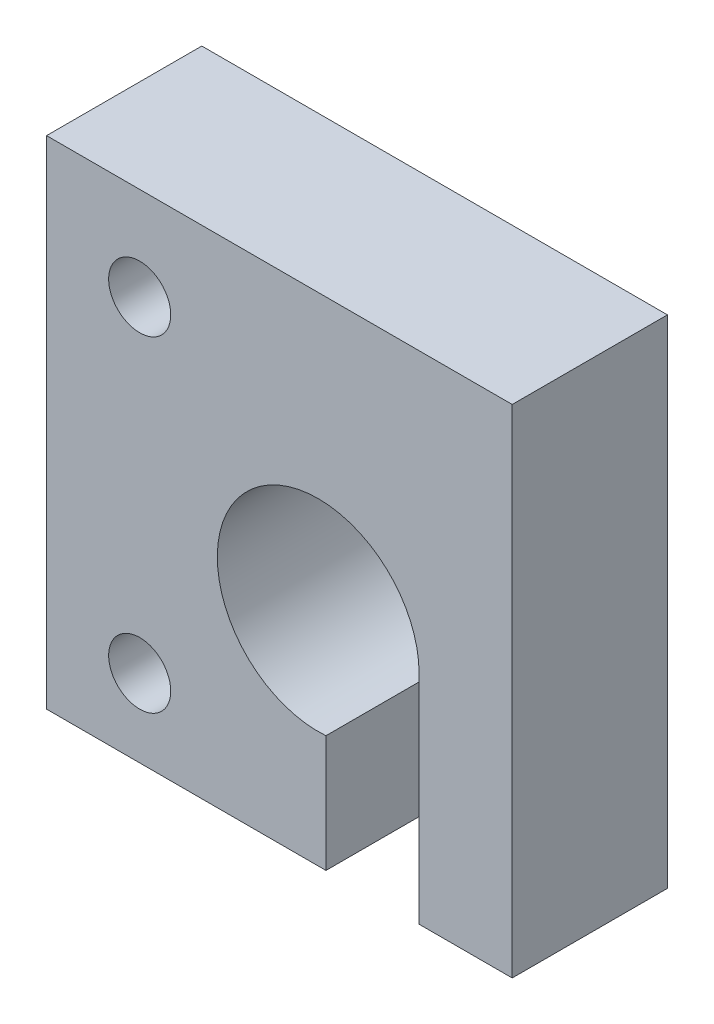
ISO-10303-21;
HEADER;
FILE_DESCRIPTION(('STEP AP214'),'2;1');
FILE_NAME('part.step','',(''),(''),'','','');
FILE_SCHEMA(('AUTOMOTIVE_DESIGN { 1 0 10303 214 1 1 1 1 }'));
ENDSEC;
DATA;
#1=APPLICATION_CONTEXT('core data for automotive mechanical design processes');
#2=APPLICATION_PROTOCOL_DEFINITION('international standard','automotive_design',2000,#1);
#3=PRODUCT_CONTEXT('',#1,'mechanical');
#4=PRODUCT('Part','Part','',(#3));
#5=PRODUCT_RELATED_PRODUCT_CATEGORY('part','',(#4));
#6=PRODUCT_DEFINITION_FORMATION('','',#4);
#7=PRODUCT_DEFINITION_CONTEXT('part definition',#1,'design');
#8=PRODUCT_DEFINITION('design','',#6,#7);
#9=PRODUCT_DEFINITION_SHAPE('','',#8);
#10=(LENGTH_UNIT() NAMED_UNIT(*) SI_UNIT(.MILLI.,.METRE.));
#11=(NAMED_UNIT(*) PLANE_ANGLE_UNIT() SI_UNIT($,.RADIAN.));
#12=(NAMED_UNIT(*) SI_UNIT($,.STERADIAN.) SOLID_ANGLE_UNIT());
#13=UNCERTAINTY_MEASURE_WITH_UNIT(LENGTH_MEASURE(1.E-05),#10,'distance_accuracy_value','');
#14=(GEOMETRIC_REPRESENTATION_CONTEXT(3) GLOBAL_UNCERTAINTY_ASSIGNED_CONTEXT((#13)) GLOBAL_UNIT_ASSIGNED_CONTEXT((#10,
#11,#12)) REPRESENTATION_CONTEXT('',''));
#15=CARTESIAN_POINT('',(0.,0.,0.));
#16=DIRECTION('',(0.,0.,1.));
#17=DIRECTION('',(1.,0.,0.));
#18=AXIS2_PLACEMENT_3D('',#15,#16,#17);
#19=CARTESIAN_POINT('',(0.,0.,10.));
#20=DIRECTION('',(0.,0.,1.));
#21=DIRECTION('',(1.,0.,0.));
#22=AXIS2_PLACEMENT_3D('',#19,#20,#21);
#23=PLANE('',#22);
#24=CARTESIAN_POINT('',(-11.5,12.,10.));
#25=DIRECTION('',(0.,0.,1.));
#26=DIRECTION('',(1.,0.,0.));
#27=AXIS2_PLACEMENT_3D('',#24,#25,#26);
#28=CIRCLE('',#27,2.);
#29=CARTESIAN_POINT('',(-9.5,12.,10.));
#30=VERTEX_POINT('',#29);
#31=EDGE_CURVE('E135',#30,#30,#28,.T.);
#32=ORIENTED_EDGE('',*,*,#31,.F.);
#33=EDGE_LOOP('',(#32));
#34=FACE_BOUND('',#33,.T.);
#35=CARTESIAN_POINT('',(0.,0.,10.));
#36=DIRECTION('',(0.,0.,-1.));
#37=DIRECTION('',(1.,0.,0.));
#38=AXIS2_PLACEMENT_3D('',#35,#36,#37);
#39=CIRCLE('',#38,6.5);
#40=CARTESIAN_POINT('',(0.499999999999999,-6.48074069840786,10.));
#41=VERTEX_POINT('',#40);
#42=CARTESIAN_POINT('',(6.5,0.,10.));
#43=VERTEX_POINT('',#42);
#44=EDGE_CURVE('E146',#41,#43,#39,.T.);
#45=ORIENTED_EDGE('',*,*,#44,.T.);
#46=DIRECTION('',(0.,-1.,0.));
#47=VECTOR('',#46,1.);
#48=CARTESIAN_POINT('',(6.5,0.,10.));
#49=LINE('',#48,#47);
#50=CARTESIAN_POINT('',(6.5,-14.,10.));
#51=VERTEX_POINT('',#50);
#52=EDGE_CURVE('E94',#43,#51,#49,.T.);
#53=ORIENTED_EDGE('',*,*,#52,.T.);
#54=DIRECTION('',(1.,0.,0.));
#55=VECTOR('',#54,1.);
#56=CARTESIAN_POINT('',(6.5,-14.,10.));
#57=LINE('',#56,#55);
#58=CARTESIAN_POINT('',(12.5,-14.,10.));
#59=VERTEX_POINT('',#58);
#60=EDGE_CURVE('E161',#51,#59,#57,.T.);
#61=ORIENTED_EDGE('',*,*,#60,.T.);
#62=DIRECTION('',(0.,1.,0.));
#63=VECTOR('',#62,1.);
#64=CARTESIAN_POINT('',(12.5,-14.,10.));
#65=LINE('',#64,#63);
#66=CARTESIAN_POINT('',(12.5,18.,10.));
#67=VERTEX_POINT('',#66);
#68=EDGE_CURVE('E174',#59,#67,#65,.T.);
#69=ORIENTED_EDGE('',*,*,#68,.T.);
#70=DIRECTION('',(-1.,0.,0.));
#71=VECTOR('',#70,1.);
#72=CARTESIAN_POINT('',(12.5,18.,10.));
#73=LINE('',#72,#71);
#74=CARTESIAN_POINT('',(-17.5,18.,10.));
#75=VERTEX_POINT('',#74);
#76=EDGE_CURVE('E113',#67,#75,#73,.T.);
#77=ORIENTED_EDGE('',*,*,#76,.T.);
#78=DIRECTION('',(0.,-1.,0.));
#79=VECTOR('',#78,1.);
#80=CARTESIAN_POINT('',(-17.5,18.,10.));
#81=LINE('',#80,#79);
#82=CARTESIAN_POINT('',(-17.5,-14.,10.));
#83=VERTEX_POINT('',#82);
#84=EDGE_CURVE('E107',#75,#83,#81,.T.);
#85=ORIENTED_EDGE('',*,*,#84,.T.);
#86=DIRECTION('',(1.,0.,0.));
#87=VECTOR('',#86,1.);
#88=CARTESIAN_POINT('',(-17.5,-14.,10.));
#89=LINE('',#88,#87);
#90=CARTESIAN_POINT('',(0.5,-14.,10.));
#91=VERTEX_POINT('',#90);
#92=EDGE_CURVE('E111',#83,#91,#89,.T.);
#93=ORIENTED_EDGE('',*,*,#92,.T.);
#94=DIRECTION('',(0.,1.,0.));
#95=VECTOR('',#94,1.);
#96=CARTESIAN_POINT('',(0.5,-14.,10.));
#97=LINE('',#96,#95);
#98=EDGE_CURVE('E51',#91,#41,#97,.T.);
#99=ORIENTED_EDGE('',*,*,#98,.T.);
#100=EDGE_LOOP('',(#45,#53,#61,#69,#77,#85,#93,#99));
#101=FACE_BOUND('',#100,.T.);
#102=CARTESIAN_POINT('',(-11.5,-9.,10.));
#103=DIRECTION('',(0.,0.,1.));
#104=DIRECTION('',(1.,0.,0.));
#105=AXIS2_PLACEMENT_3D('',#102,#103,#104);
#106=CIRCLE('',#105,2.);
#107=CARTESIAN_POINT('',(-9.5,-9.,10.));
#108=VERTEX_POINT('',#107);
#109=EDGE_CURVE('E183',#108,#108,#106,.T.);
#110=ORIENTED_EDGE('',*,*,#109,.F.);
#111=EDGE_LOOP('',(#110));
#112=FACE_BOUND('',#111,.T.);
#113=ADVANCED_FACE('F34',(#34,#101,#112),#23,.T.);
#114=CARTESIAN_POINT('',(0.,0.,0.));
#115=DIRECTION('',(0.,0.,1.));
#116=DIRECTION('',(1.,0.,0.));
#117=AXIS2_PLACEMENT_3D('',#114,#115,#116);
#118=PLANE('',#117);
#119=CARTESIAN_POINT('',(0.,0.,0.));
#120=DIRECTION('',(0.,0.,-1.));
#121=DIRECTION('',(1.,0.,0.));
#122=AXIS2_PLACEMENT_3D('',#119,#120,#121);
#123=CIRCLE('',#122,6.5);
#124=CARTESIAN_POINT('',(0.499999999999999,-6.48074069840786,0.));
#125=VERTEX_POINT('',#124);
#126=CARTESIAN_POINT('',(6.5,0.,0.));
#127=VERTEX_POINT('',#126);
#128=EDGE_CURVE('E131',#125,#127,#123,.T.);
#129=ORIENTED_EDGE('',*,*,#128,.F.);
#130=DIRECTION('',(0.,1.,0.));
#131=VECTOR('',#130,1.);
#132=CARTESIAN_POINT('',(0.5,-14.,0.));
#133=LINE('',#132,#131);
#134=CARTESIAN_POINT('',(0.5,-14.,0.));
#135=VERTEX_POINT('',#134);
#136=EDGE_CURVE('E86',#135,#125,#133,.T.);
#137=ORIENTED_EDGE('',*,*,#136,.F.);
#138=DIRECTION('',(1.,0.,0.));
#139=VECTOR('',#138,1.);
#140=CARTESIAN_POINT('',(-17.5,-14.,0.));
#141=LINE('',#140,#139);
#142=CARTESIAN_POINT('',(-17.5,-14.,0.));
#143=VERTEX_POINT('',#142);
#144=EDGE_CURVE('E80',#143,#135,#141,.T.);
#145=ORIENTED_EDGE('',*,*,#144,.F.);
#146=DIRECTION('',(0.,-1.,0.));
#147=VECTOR('',#146,1.);
#148=CARTESIAN_POINT('',(-17.5,18.,0.));
#149=LINE('',#148,#147);
#150=CARTESIAN_POINT('',(-17.5,18.,0.));
#151=VERTEX_POINT('',#150);
#152=EDGE_CURVE('E121',#151,#143,#149,.T.);
#153=ORIENTED_EDGE('',*,*,#152,.F.);
#154=DIRECTION('',(-1.,0.,0.));
#155=VECTOR('',#154,1.);
#156=CARTESIAN_POINT('',(12.5,18.,0.));
#157=LINE('',#156,#155);
#158=CARTESIAN_POINT('',(12.5,18.,0.));
#159=VERTEX_POINT('',#158);
#160=EDGE_CURVE('E141',#159,#151,#157,.T.);
#161=ORIENTED_EDGE('',*,*,#160,.F.);
#162=DIRECTION('',(0.,1.,0.));
#163=VECTOR('',#162,1.);
#164=CARTESIAN_POINT('',(12.5,-14.,0.));
#165=LINE('',#164,#163);
#166=CARTESIAN_POINT('',(12.5,-14.,0.));
#167=VERTEX_POINT('',#166);
#168=EDGE_CURVE('E139',#167,#159,#165,.T.);
#169=ORIENTED_EDGE('',*,*,#168,.F.);
#170=DIRECTION('',(1.,0.,0.));
#171=VECTOR('',#170,1.);
#172=CARTESIAN_POINT('',(6.5,-14.,0.));
#173=LINE('',#172,#171);
#174=CARTESIAN_POINT('',(6.5,-14.,0.));
#175=VERTEX_POINT('',#174);
#176=EDGE_CURVE('E137',#175,#167,#173,.T.);
#177=ORIENTED_EDGE('',*,*,#176,.F.);
#178=DIRECTION('',(0.,-1.,0.));
#179=VECTOR('',#178,1.);
#180=CARTESIAN_POINT('',(6.5,0.,0.));
#181=LINE('',#180,#179);
#182=EDGE_CURVE('E134',#127,#175,#181,.T.);
#183=ORIENTED_EDGE('',*,*,#182,.F.);
#184=EDGE_LOOP('',(#129,#137,#145,#153,#161,#169,#177,#183));
#185=FACE_BOUND('',#184,.T.);
#186=CARTESIAN_POINT('',(-11.5,12.,0.));
#187=DIRECTION('',(0.,0.,1.));
#188=DIRECTION('',(1.,0.,0.));
#189=AXIS2_PLACEMENT_3D('',#186,#187,#188);
#190=CIRCLE('',#189,2.);
#191=CARTESIAN_POINT('',(-9.5,12.,0.));
#192=VERTEX_POINT('',#191);
#193=EDGE_CURVE('E180',#192,#192,#190,.T.);
#194=ORIENTED_EDGE('',*,*,#193,.T.);
#195=EDGE_LOOP('',(#194));
#196=FACE_BOUND('',#195,.T.);
#197=CARTESIAN_POINT('',(-11.5,-9.,0.));
#198=DIRECTION('',(0.,0.,1.));
#199=DIRECTION('',(1.,0.,0.));
#200=AXIS2_PLACEMENT_3D('',#197,#198,#199);
#201=CIRCLE('',#200,2.);
#202=CARTESIAN_POINT('',(-9.5,-9.,0.));
#203=VERTEX_POINT('',#202);
#204=EDGE_CURVE('E186',#203,#203,#201,.T.);
#205=ORIENTED_EDGE('',*,*,#204,.T.);
#206=EDGE_LOOP('',(#205));
#207=FACE_BOUND('',#206,.T.);
#208=ADVANCED_FACE('F165',(#185,#196,#207),#118,.F.);
#209=CARTESIAN_POINT('',(0.,0.,10.));
#210=DIRECTION('',(0.,0.,-1.));
#211=DIRECTION('',(-1.,0.,0.));
#212=AXIS2_PLACEMENT_3D('',#209,#210,#211);
#213=CYLINDRICAL_SURFACE('',#212,6.5);
#214=ORIENTED_EDGE('',*,*,#128,.T.);
#215=DIRECTION('',(0.,0.,-1.));
#216=VECTOR('',#215,1.);
#217=CARTESIAN_POINT('',(6.5,0.,10.));
#218=LINE('',#217,#216);
#219=EDGE_CURVE('E11',#43,#127,#218,.T.);
#220=ORIENTED_EDGE('',*,*,#219,.F.);
#221=ORIENTED_EDGE('',*,*,#44,.F.);
#222=DIRECTION('',(0.,0.,-1.));
#223=VECTOR('',#222,1.);
#224=CARTESIAN_POINT('',(0.499999999999999,-6.48074069840786,10.));
#225=LINE('',#224,#223);
#226=EDGE_CURVE('E127',#41,#125,#225,.T.);
#227=ORIENTED_EDGE('',*,*,#226,.T.);
#228=EDGE_LOOP('',(#214,#220,#221,#227));
#229=FACE_BOUND('',#228,.T.);
#230=ADVANCED_FACE('F36',(#229),#213,.F.);
#231=CARTESIAN_POINT('',(6.5,0.,10.));
#232=DIRECTION('',(1.,0.,0.));
#233=DIRECTION('',(0.,1.,0.));
#234=AXIS2_PLACEMENT_3D('',#231,#232,#233);
#235=PLANE('',#234);
#236=ORIENTED_EDGE('',*,*,#182,.T.);
#237=DIRECTION('',(0.,0.,-1.));
#238=VECTOR('',#237,1.);
#239=CARTESIAN_POINT('',(6.5,-14.,10.));
#240=LINE('',#239,#238);
#241=EDGE_CURVE('E43',#51,#175,#240,.T.);
#242=ORIENTED_EDGE('',*,*,#241,.F.);
#243=ORIENTED_EDGE('',*,*,#52,.F.);
#244=ORIENTED_EDGE('',*,*,#219,.T.);
#245=EDGE_LOOP('',(#236,#242,#243,#244));
#246=FACE_BOUND('',#245,.T.);
#247=ADVANCED_FACE('F218',(#246),#235,.F.);
#248=CARTESIAN_POINT('',(6.5,-14.,10.));
#249=DIRECTION('',(0.,1.,0.));
#250=DIRECTION('',(0.,0.,1.));
#251=AXIS2_PLACEMENT_3D('',#248,#249,#250);
#252=PLANE('',#251);
#253=ORIENTED_EDGE('',*,*,#176,.T.);
#254=DIRECTION('',(0.,0.,-1.));
#255=VECTOR('',#254,1.);
#256=CARTESIAN_POINT('',(12.5,-14.,10.));
#257=LINE('',#256,#255);
#258=EDGE_CURVE('E153',#59,#167,#257,.T.);
#259=ORIENTED_EDGE('',*,*,#258,.F.);
#260=ORIENTED_EDGE('',*,*,#60,.F.);
#261=ORIENTED_EDGE('',*,*,#241,.T.);
#262=EDGE_LOOP('',(#253,#259,#260,#261));
#263=FACE_BOUND('',#262,.T.);
#264=ADVANCED_FACE('F159',(#263),#252,.F.);
#265=CARTESIAN_POINT('',(12.5,-14.,10.));
#266=DIRECTION('',(-1.,0.,0.));
#267=DIRECTION('',(0.,0.,1.));
#268=AXIS2_PLACEMENT_3D('',#265,#266,#267);
#269=PLANE('',#268);
#270=ORIENTED_EDGE('',*,*,#168,.T.);
#271=DIRECTION('',(0.,0.,-1.));
#272=VECTOR('',#271,1.);
#273=CARTESIAN_POINT('',(12.5,18.,10.));
#274=LINE('',#273,#272);
#275=EDGE_CURVE('E150',#67,#159,#274,.T.);
#276=ORIENTED_EDGE('',*,*,#275,.F.);
#277=ORIENTED_EDGE('',*,*,#68,.F.);
#278=ORIENTED_EDGE('',*,*,#258,.T.);
#279=EDGE_LOOP('',(#270,#276,#277,#278));
#280=FACE_BOUND('',#279,.T.);
#281=ADVANCED_FACE('F170',(#280),#269,.F.);
#282=CARTESIAN_POINT('',(12.5,18.,10.));
#283=DIRECTION('',(0.,-1.,0.));
#284=DIRECTION('',(1.,0.,0.));
#285=AXIS2_PLACEMENT_3D('',#282,#283,#284);
#286=PLANE('',#285);
#287=ORIENTED_EDGE('',*,*,#160,.T.);
#288=DIRECTION('',(0.,0.,-1.));
#289=VECTOR('',#288,1.);
#290=CARTESIAN_POINT('',(-17.5,18.,10.));
#291=LINE('',#290,#289);
#292=EDGE_CURVE('E122',#75,#151,#291,.T.);
#293=ORIENTED_EDGE('',*,*,#292,.F.);
#294=ORIENTED_EDGE('',*,*,#76,.F.);
#295=ORIENTED_EDGE('',*,*,#275,.T.);
#296=EDGE_LOOP('',(#287,#293,#294,#295));
#297=FACE_BOUND('',#296,.T.);
#298=ADVANCED_FACE('F173',(#297),#286,.F.);
#299=CARTESIAN_POINT('',(-17.5,18.,10.));
#300=DIRECTION('',(1.,0.,0.));
#301=DIRECTION('',(0.,1.,0.));
#302=AXIS2_PLACEMENT_3D('',#299,#300,#301);
#303=PLANE('',#302);
#304=ORIENTED_EDGE('',*,*,#152,.T.);
#305=DIRECTION('',(0.,0.,-1.));
#306=VECTOR('',#305,1.);
#307=CARTESIAN_POINT('',(-17.5,-14.,10.));
#308=LINE('',#307,#306);
#309=EDGE_CURVE('E118',#83,#143,#308,.T.);
#310=ORIENTED_EDGE('',*,*,#309,.F.);
#311=ORIENTED_EDGE('',*,*,#84,.F.);
#312=ORIENTED_EDGE('',*,*,#292,.T.);
#313=EDGE_LOOP('',(#304,#310,#311,#312));
#314=FACE_BOUND('',#313,.T.);
#315=ADVANCED_FACE('F119',(#314),#303,.F.);
#316=CARTESIAN_POINT('',(-17.5,-14.,10.));
#317=DIRECTION('',(0.,1.,0.));
#318=DIRECTION('',(-1.,0.,0.));
#319=AXIS2_PLACEMENT_3D('',#316,#317,#318);
#320=PLANE('',#319);
#321=ORIENTED_EDGE('',*,*,#144,.T.);
#322=DIRECTION('',(0.,0.,-1.));
#323=VECTOR('',#322,1.);
#324=CARTESIAN_POINT('',(0.5,-14.,10.));
#325=LINE('',#324,#323);
#326=EDGE_CURVE('E123',#91,#135,#325,.T.);
#327=ORIENTED_EDGE('',*,*,#326,.F.);
#328=ORIENTED_EDGE('',*,*,#92,.F.);
#329=ORIENTED_EDGE('',*,*,#309,.T.);
#330=EDGE_LOOP('',(#321,#327,#328,#329));
#331=FACE_BOUND('',#330,.T.);
#332=ADVANCED_FACE('F125',(#331),#320,.F.);
#333=CARTESIAN_POINT('',(0.5,-14.,10.));
#334=DIRECTION('',(-1.,0.,0.));
#335=DIRECTION('',(0.,-1.,0.));
#336=AXIS2_PLACEMENT_3D('',#333,#334,#335);
#337=PLANE('',#336);
#338=ORIENTED_EDGE('',*,*,#136,.T.);
#339=ORIENTED_EDGE('',*,*,#226,.F.);
#340=ORIENTED_EDGE('',*,*,#98,.F.);
#341=ORIENTED_EDGE('',*,*,#326,.T.);
#342=EDGE_LOOP('',(#338,#339,#340,#341));
#343=FACE_BOUND('',#342,.T.);
#344=ADVANCED_FACE('F206',(#343),#337,.F.);
#345=CARTESIAN_POINT('',(-11.5,12.,10.));
#346=DIRECTION('',(0.,0.,-1.));
#347=DIRECTION('',(-1.,0.,0.));
#348=AXIS2_PLACEMENT_3D('',#345,#346,#347);
#349=CYLINDRICAL_SURFACE('',#348,2.);
#350=ORIENTED_EDGE('',*,*,#31,.T.);
#351=EDGE_LOOP('',(#350));
#352=FACE_BOUND('',#351,.T.);
#353=ORIENTED_EDGE('',*,*,#193,.F.);
#354=EDGE_LOOP('',(#353));
#355=FACE_BOUND('',#354,.T.);
#356=ADVANCED_FACE('F203',(#352,#355),#349,.F.);
#357=CARTESIAN_POINT('',(-11.5,-9.,10.));
#358=DIRECTION('',(0.,0.,-1.));
#359=DIRECTION('',(-1.,0.,0.));
#360=AXIS2_PLACEMENT_3D('',#357,#358,#359);
#361=CYLINDRICAL_SURFACE('',#360,2.);
#362=ORIENTED_EDGE('',*,*,#109,.T.);
#363=EDGE_LOOP('',(#362));
#364=FACE_BOUND('',#363,.T.);
#365=ORIENTED_EDGE('',*,*,#204,.F.);
#366=EDGE_LOOP('',(#365));
#367=FACE_BOUND('',#366,.T.);
#368=ADVANCED_FACE('F192',(#364,#367),#361,.F.);
#369=CLOSED_SHELL('',(#113,#208,#230,#247,#264,#281,#298,#315,#332,#344,#356,#368));
#370=MANIFOLD_SOLID_BREP('B2',#369);
#371=ADVANCED_BREP_SHAPE_REPRESENTATION('',(#18,#370),#14);
#372=SHAPE_DEFINITION_REPRESENTATION(#9,#371);
ENDSEC;
END-ISO-10303-21;
